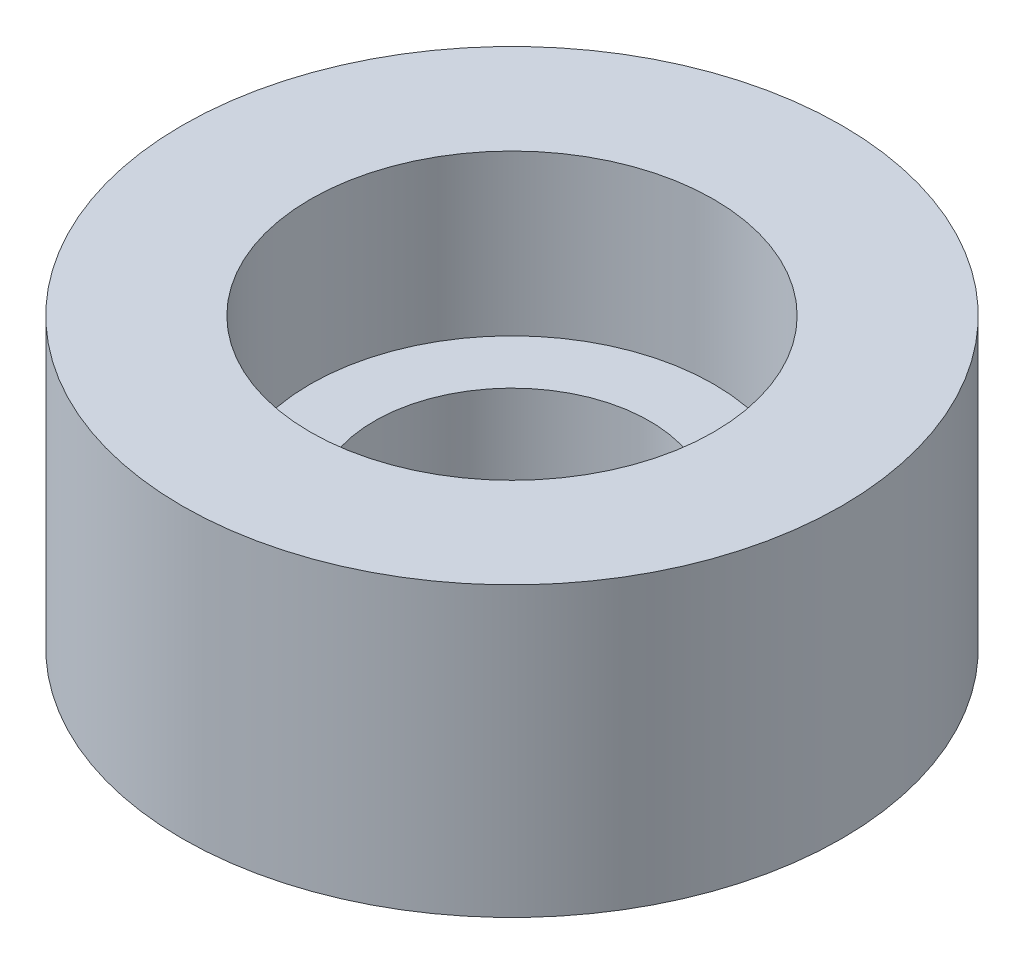
ISO-10303-21;
HEADER;
FILE_DESCRIPTION(('STEP AP214'),'2;1');
FILE_NAME('part.step','',(''),(''),'','','');
FILE_SCHEMA(('AUTOMOTIVE_DESIGN { 1 0 10303 214 1 1 1 1 }'));
ENDSEC;
DATA;
#1=APPLICATION_CONTEXT('core data for automotive mechanical design processes');
#2=APPLICATION_PROTOCOL_DEFINITION('international standard','automotive_design',2000,#1);
#3=PRODUCT_CONTEXT('',#1,'mechanical');
#4=PRODUCT('Part','Part','',(#3));
#5=PRODUCT_RELATED_PRODUCT_CATEGORY('part','',(#4));
#6=PRODUCT_DEFINITION_FORMATION('','',#4);
#7=PRODUCT_DEFINITION_CONTEXT('part definition',#1,'design');
#8=PRODUCT_DEFINITION('design','',#6,#7);
#9=PRODUCT_DEFINITION_SHAPE('','',#8);
#10=(LENGTH_UNIT() NAMED_UNIT(*) SI_UNIT(.MILLI.,.METRE.));
#11=(NAMED_UNIT(*) PLANE_ANGLE_UNIT() SI_UNIT($,.RADIAN.));
#12=(NAMED_UNIT(*) SI_UNIT($,.STERADIAN.) SOLID_ANGLE_UNIT());
#13=UNCERTAINTY_MEASURE_WITH_UNIT(LENGTH_MEASURE(1.E-05),#10,'distance_accuracy_value','');
#14=(GEOMETRIC_REPRESENTATION_CONTEXT(3) GLOBAL_UNCERTAINTY_ASSIGNED_CONTEXT((#13)) GLOBAL_UNIT_ASSIGNED_CONTEXT((#10,
#11,#12)) REPRESENTATION_CONTEXT('',''));
#15=CARTESIAN_POINT('',(0.,0.,0.));
#16=DIRECTION('',(0.,0.,1.));
#17=DIRECTION('',(1.,0.,0.));
#18=AXIS2_PLACEMENT_3D('',#15,#16,#17);
#19=CARTESIAN_POINT('',(0.,4.5,0.));
#20=DIRECTION('',(0.,1.,0.));
#21=DIRECTION('',(0.,0.,1.));
#22=AXIS2_PLACEMENT_3D('',#19,#20,#21);
#23=PLANE('',#22);
#24=CARTESIAN_POINT('',(0.,4.5,0.));
#25=DIRECTION('',(0.,1.,0.));
#26=DIRECTION('',(1.,0.,0.));
#27=AXIS2_PLACEMENT_3D('',#24,#25,#26);
#28=CIRCLE('',#27,5.15);
#29=CARTESIAN_POINT('',(5.15,4.5,0.));
#30=VERTEX_POINT('',#29);
#31=EDGE_CURVE('E57',#30,#30,#28,.T.);
#32=ORIENTED_EDGE('',*,*,#31,.T.);
#33=EDGE_LOOP('',(#32));
#34=FACE_BOUND('',#33,.T.);
#35=CARTESIAN_POINT('',(0.,4.5,0.));
#36=DIRECTION('',(0.,1.,0.));
#37=DIRECTION('',(0.,0.,1.));
#38=AXIS2_PLACEMENT_3D('',#35,#36,#37);
#39=CIRCLE('',#38,3.15);
#40=CARTESIAN_POINT('',(0.,4.5,3.15));
#41=VERTEX_POINT('',#40);
#42=EDGE_CURVE('E68',#41,#41,#39,.T.);
#43=ORIENTED_EDGE('',*,*,#42,.F.);
#44=EDGE_LOOP('',(#43));
#45=FACE_BOUND('',#44,.T.);
#46=ADVANCED_FACE('F49',(#34,#45),#23,.T.);
#47=CARTESIAN_POINT('',(0.,0.,0.));
#48=DIRECTION('',(0.,1.,0.));
#49=DIRECTION('',(0.,0.,1.));
#50=AXIS2_PLACEMENT_3D('',#47,#48,#49);
#51=PLANE('',#50);
#52=CARTESIAN_POINT('',(0.,0.,0.));
#53=DIRECTION('',(0.,1.,0.));
#54=DIRECTION('',(1.,0.,0.));
#55=AXIS2_PLACEMENT_3D('',#52,#53,#54);
#56=CIRCLE('',#55,5.15);
#57=CARTESIAN_POINT('',(5.15,0.,0.));
#58=VERTEX_POINT('',#57);
#59=EDGE_CURVE('E62',#58,#58,#56,.T.);
#60=ORIENTED_EDGE('',*,*,#59,.F.);
#61=EDGE_LOOP('',(#60));
#62=FACE_BOUND('',#61,.T.);
#63=CARTESIAN_POINT('',(0.,0.,0.));
#64=DIRECTION('',(0.,1.,0.));
#65=DIRECTION('',(0.,0.,1.));
#66=AXIS2_PLACEMENT_3D('',#63,#64,#65);
#67=CIRCLE('',#66,2.15);
#68=CARTESIAN_POINT('',(0.,0.,2.15));
#69=VERTEX_POINT('',#68);
#70=EDGE_CURVE('E74',#69,#69,#67,.T.);
#71=ORIENTED_EDGE('',*,*,#70,.T.);
#72=EDGE_LOOP('',(#71));
#73=FACE_BOUND('',#72,.T.);
#74=ADVANCED_FACE('F97',(#62,#73),#51,.F.);
#75=CARTESIAN_POINT('',(0.,4.5,0.));
#76=DIRECTION('',(0.,-1.,0.));
#77=DIRECTION('',(0.,0.,-1.));
#78=AXIS2_PLACEMENT_3D('',#75,#76,#77);
#79=CYLINDRICAL_SURFACE('',#78,5.15);
#80=ORIENTED_EDGE('',*,*,#31,.F.);
#81=EDGE_LOOP('',(#80));
#82=FACE_BOUND('',#81,.T.);
#83=ORIENTED_EDGE('',*,*,#59,.T.);
#84=EDGE_LOOP('',(#83));
#85=FACE_BOUND('',#84,.T.);
#86=ADVANCED_FACE('F51',(#82,#85),#79,.T.);
#87=CARTESIAN_POINT('',(0.,4.5,0.));
#88=DIRECTION('',(0.,-1.,0.));
#89=DIRECTION('',(0.,0.,-1.));
#90=AXIS2_PLACEMENT_3D('',#87,#88,#89);
#91=CYLINDRICAL_SURFACE('',#90,3.15);
#92=CARTESIAN_POINT('',(0.,2.,0.));
#93=DIRECTION('',(0.,1.,0.));
#94=DIRECTION('',(0.,0.,1.));
#95=AXIS2_PLACEMENT_3D('',#92,#93,#94);
#96=CIRCLE('',#95,3.15);
#97=CARTESIAN_POINT('',(0.,2.,3.15));
#98=VERTEX_POINT('',#97);
#99=EDGE_CURVE('E11',#98,#98,#96,.T.);
#100=ORIENTED_EDGE('',*,*,#99,.F.);
#101=EDGE_LOOP('',(#100));
#102=FACE_BOUND('',#101,.T.);
#103=ORIENTED_EDGE('',*,*,#42,.T.);
#104=EDGE_LOOP('',(#103));
#105=FACE_BOUND('',#104,.T.);
#106=ADVANCED_FACE('F87',(#102,#105),#91,.F.);
#107=CARTESIAN_POINT('',(0.,2.,0.));
#108=DIRECTION('',(0.,1.,0.));
#109=DIRECTION('',(0.,0.,1.));
#110=AXIS2_PLACEMENT_3D('',#107,#108,#109);
#111=PLANE('',#110);
#112=ORIENTED_EDGE('',*,*,#99,.T.);
#113=EDGE_LOOP('',(#112));
#114=FACE_BOUND('',#113,.T.);
#115=CARTESIAN_POINT('',(0.,2.,0.));
#116=DIRECTION('',(0.,1.,0.));
#117=DIRECTION('',(0.,0.,1.));
#118=AXIS2_PLACEMENT_3D('',#115,#116,#117);
#119=CIRCLE('',#118,2.15);
#120=CARTESIAN_POINT('',(0.,2.,2.15));
#121=VERTEX_POINT('',#120);
#122=EDGE_CURVE('E73',#121,#121,#119,.T.);
#123=ORIENTED_EDGE('',*,*,#122,.F.);
#124=EDGE_LOOP('',(#123));
#125=FACE_BOUND('',#124,.T.);
#126=ADVANCED_FACE('F85',(#114,#125),#111,.T.);
#127=CARTESIAN_POINT('',(0.,2.,0.));
#128=DIRECTION('',(0.,-1.,0.));
#129=DIRECTION('',(0.,0.,-1.));
#130=AXIS2_PLACEMENT_3D('',#127,#128,#129);
#131=CYLINDRICAL_SURFACE('',#130,2.15);
#132=ORIENTED_EDGE('',*,*,#122,.T.);
#133=EDGE_LOOP('',(#132));
#134=FACE_BOUND('',#133,.T.);
#135=ORIENTED_EDGE('',*,*,#70,.F.);
#136=EDGE_LOOP('',(#135));
#137=FACE_BOUND('',#136,.T.);
#138=ADVANCED_FACE('F82',(#134,#137),#131,.F.);
#139=CLOSED_SHELL('',(#46,#74,#86,#106,#126,#138));
#140=MANIFOLD_SOLID_BREP('B2',#139);
#141=ADVANCED_BREP_SHAPE_REPRESENTATION('',(#18,#140),#14);
#142=SHAPE_DEFINITION_REPRESENTATION(#9,#141);
ENDSEC;
END-ISO-10303-21;
